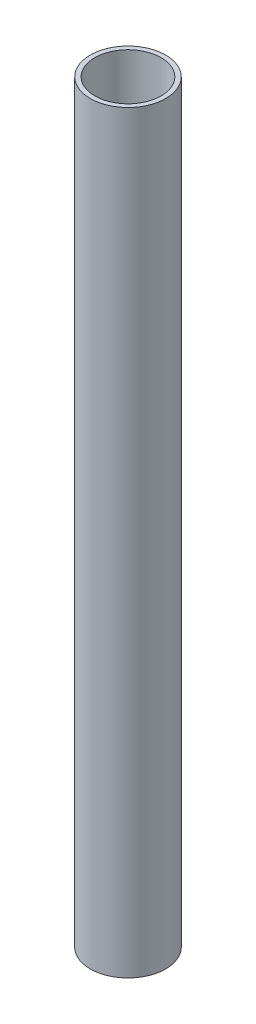
ISO-10303-21;
HEADER;
FILE_DESCRIPTION(('STEP AP214'),'2;1');
FILE_NAME('part.step','',(''),(''),'','','');
FILE_SCHEMA(('AUTOMOTIVE_DESIGN { 1 0 10303 214 1 1 1 1 }'));
ENDSEC;
DATA;
#1=APPLICATION_CONTEXT('core data for automotive mechanical design processes');
#2=APPLICATION_PROTOCOL_DEFINITION('international standard','automotive_design',2000,#1);
#3=PRODUCT_CONTEXT('',#1,'mechanical');
#4=PRODUCT('Part','Part','',(#3));
#5=PRODUCT_RELATED_PRODUCT_CATEGORY('part','',(#4));
#6=PRODUCT_DEFINITION_FORMATION('','',#4);
#7=PRODUCT_DEFINITION_CONTEXT('part definition',#1,'design');
#8=PRODUCT_DEFINITION('design','',#6,#7);
#9=PRODUCT_DEFINITION_SHAPE('','',#8);
#10=(LENGTH_UNIT() NAMED_UNIT(*) SI_UNIT(.MILLI.,.METRE.));
#11=(NAMED_UNIT(*) PLANE_ANGLE_UNIT() SI_UNIT($,.RADIAN.));
#12=(NAMED_UNIT(*) SI_UNIT($,.STERADIAN.) SOLID_ANGLE_UNIT());
#13=UNCERTAINTY_MEASURE_WITH_UNIT(LENGTH_MEASURE(1.E-05),#10,'distance_accuracy_value','');
#14=(GEOMETRIC_REPRESENTATION_CONTEXT(3) GLOBAL_UNCERTAINTY_ASSIGNED_CONTEXT((#13)) GLOBAL_UNIT_ASSIGNED_CONTEXT((#10,
#11,#12)) REPRESENTATION_CONTEXT('',''));
#15=CARTESIAN_POINT('',(0.,0.,0.));
#16=DIRECTION('',(0.,0.,1.));
#17=DIRECTION('',(1.,0.,0.));
#18=AXIS2_PLACEMENT_3D('',#15,#16,#17);
#19=CARTESIAN_POINT('',(0.,254.,0.));
#20=DIRECTION('',(0.,1.,0.));
#21=DIRECTION('',(0.,0.,1.));
#22=AXIS2_PLACEMENT_3D('',#19,#20,#21);
#23=PLANE('',#22);
#24=CARTESIAN_POINT('',(0.,254.,0.));
#25=DIRECTION('',(0.,1.,0.));
#26=DIRECTION('',(0.,0.,1.));
#27=AXIS2_PLACEMENT_3D('',#24,#25,#26);
#28=CIRCLE('',#27,12.7);
#29=CARTESIAN_POINT('',(0.,254.,12.7));
#30=VERTEX_POINT('',#29);
#31=EDGE_CURVE('E10',#30,#30,#28,.T.);
#32=ORIENTED_EDGE('',*,*,#31,.T.);
#33=EDGE_LOOP('',(#32));
#34=FACE_BOUND('',#33,.T.);
#35=CARTESIAN_POINT('',(0.,254.,0.));
#36=DIRECTION('',(0.,1.,0.));
#37=DIRECTION('',(0.,0.,1.));
#38=AXIS2_PLACEMENT_3D('',#35,#36,#37);
#39=CIRCLE('',#38,11.176);
#40=CARTESIAN_POINT('',(0.,254.,11.176));
#41=VERTEX_POINT('',#40);
#42=EDGE_CURVE('E42',#41,#41,#39,.T.);
#43=ORIENTED_EDGE('',*,*,#42,.F.);
#44=EDGE_LOOP('',(#43));
#45=FACE_BOUND('',#44,.T.);
#46=ADVANCED_FACE('F31',(#34,#45),#23,.T.);
#47=CARTESIAN_POINT('',(0.,0.,0.));
#48=DIRECTION('',(0.,1.,0.));
#49=DIRECTION('',(0.,0.,1.));
#50=AXIS2_PLACEMENT_3D('',#47,#48,#49);
#51=PLANE('',#50);
#52=CARTESIAN_POINT('',(0.,0.,0.));
#53=DIRECTION('',(0.,1.,0.));
#54=DIRECTION('',(0.,0.,1.));
#55=AXIS2_PLACEMENT_3D('',#52,#53,#54);
#56=CIRCLE('',#55,12.7);
#57=CARTESIAN_POINT('',(0.,0.,12.7));
#58=VERTEX_POINT('',#57);
#59=EDGE_CURVE('E35',#58,#58,#56,.T.);
#60=ORIENTED_EDGE('',*,*,#59,.F.);
#61=EDGE_LOOP('',(#60));
#62=FACE_BOUND('',#61,.T.);
#63=CARTESIAN_POINT('',(0.,0.,0.));
#64=DIRECTION('',(0.,1.,0.));
#65=DIRECTION('',(0.,0.,1.));
#66=AXIS2_PLACEMENT_3D('',#63,#64,#65);
#67=CIRCLE('',#66,11.176);
#68=CARTESIAN_POINT('',(0.,0.,11.176));
#69=VERTEX_POINT('',#68);
#70=EDGE_CURVE('E44',#69,#69,#67,.T.);
#71=ORIENTED_EDGE('',*,*,#70,.T.);
#72=EDGE_LOOP('',(#71));
#73=FACE_BOUND('',#72,.T.);
#74=ADVANCED_FACE('F54',(#62,#73),#51,.F.);
#75=CARTESIAN_POINT('',(0.,254.,0.));
#76=DIRECTION('',(0.,-1.,0.));
#77=DIRECTION('',(0.,0.,-1.));
#78=AXIS2_PLACEMENT_3D('',#75,#76,#77);
#79=CYLINDRICAL_SURFACE('',#78,12.7);
#80=ORIENTED_EDGE('',*,*,#31,.F.);
#81=EDGE_LOOP('',(#80));
#82=FACE_BOUND('',#81,.T.);
#83=ORIENTED_EDGE('',*,*,#59,.T.);
#84=EDGE_LOOP('',(#83));
#85=FACE_BOUND('',#84,.T.);
#86=ADVANCED_FACE('F33',(#82,#85),#79,.T.);
#87=CARTESIAN_POINT('',(0.,254.,0.));
#88=DIRECTION('',(0.,-1.,0.));
#89=DIRECTION('',(0.,0.,-1.));
#90=AXIS2_PLACEMENT_3D('',#87,#88,#89);
#91=CYLINDRICAL_SURFACE('',#90,11.176);
#92=ORIENTED_EDGE('',*,*,#42,.T.);
#93=EDGE_LOOP('',(#92));
#94=FACE_BOUND('',#93,.T.);
#95=ORIENTED_EDGE('',*,*,#70,.F.);
#96=EDGE_LOOP('',(#95));
#97=FACE_BOUND('',#96,.T.);
#98=ADVANCED_FACE('F50',(#94,#97),#91,.F.);
#99=CLOSED_SHELL('',(#46,#74,#86,#98));
#100=MANIFOLD_SOLID_BREP('B2',#99);
#101=ADVANCED_BREP_SHAPE_REPRESENTATION('',(#18,#100),#14);
#102=SHAPE_DEFINITION_REPRESENTATION(#9,#101);
ENDSEC;
END-ISO-10303-21;
